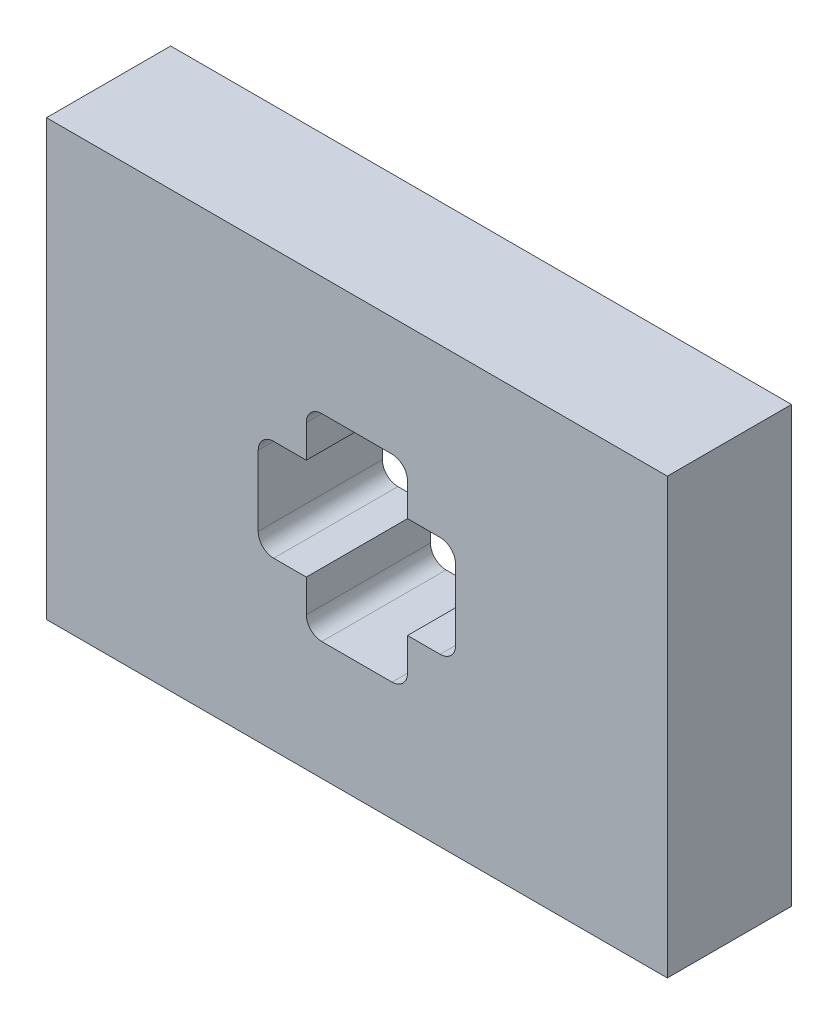
ISO-10303-21;
HEADER;
FILE_DESCRIPTION(('STEP AP214'),'2;1');
FILE_NAME('part.step','',(''),(''),'','','');
FILE_SCHEMA(('AUTOMOTIVE_DESIGN { 1 0 10303 214 1 1 1 1 }'));
ENDSEC;
DATA;
#1=APPLICATION_CONTEXT('core data for automotive mechanical design processes');
#2=APPLICATION_PROTOCOL_DEFINITION('international standard','automotive_design',2000,#1);
#3=PRODUCT_CONTEXT('',#1,'mechanical');
#4=PRODUCT('Part','Part','',(#3));
#5=PRODUCT_RELATED_PRODUCT_CATEGORY('part','',(#4));
#6=PRODUCT_DEFINITION_FORMATION('','',#4);
#7=PRODUCT_DEFINITION_CONTEXT('part definition',#1,'design');
#8=PRODUCT_DEFINITION('design','',#6,#7);
#9=PRODUCT_DEFINITION_SHAPE('','',#8);
#10=(LENGTH_UNIT() NAMED_UNIT(*) SI_UNIT(.MILLI.,.METRE.));
#11=(NAMED_UNIT(*) PLANE_ANGLE_UNIT() SI_UNIT($,.RADIAN.));
#12=(NAMED_UNIT(*) SI_UNIT($,.STERADIAN.) SOLID_ANGLE_UNIT());
#13=UNCERTAINTY_MEASURE_WITH_UNIT(LENGTH_MEASURE(1.E-05),#10,'distance_accuracy_value','');
#14=(GEOMETRIC_REPRESENTATION_CONTEXT(3) GLOBAL_UNCERTAINTY_ASSIGNED_CONTEXT((#13)) GLOBAL_UNIT_ASSIGNED_CONTEXT((#10,
#11,#12)) REPRESENTATION_CONTEXT('',''));
#15=CARTESIAN_POINT('',(0.,0.,0.));
#16=DIRECTION('',(0.,0.,1.));
#17=DIRECTION('',(1.,0.,0.));
#18=AXIS2_PLACEMENT_3D('',#15,#16,#17);
#19=CARTESIAN_POINT('',(0.,0.,20.));
#20=DIRECTION('',(0.,0.,1.));
#21=DIRECTION('',(1.,0.,0.));
#22=AXIS2_PLACEMENT_3D('',#19,#20,#21);
#23=PLANE('',#22);
#24=DIRECTION('',(0.,-1.,0.));
#25=VECTOR('',#24,1.);
#26=CARTESIAN_POINT('',(-50.,-35.,20.));
#27=LINE('',#26,#25);
#28=CARTESIAN_POINT('',(-50.,35.,20.));
#29=VERTEX_POINT('',#28);
#30=CARTESIAN_POINT('',(-50.,-35.,20.));
#31=VERTEX_POINT('',#30);
#32=EDGE_CURVE('E343',#29,#31,#27,.T.);
#33=ORIENTED_EDGE('',*,*,#32,.T.);
#34=DIRECTION('',(1.,0.,0.));
#35=VECTOR('',#34,1.);
#36=CARTESIAN_POINT('',(50.,-35.,20.));
#37=LINE('',#36,#35);
#38=CARTESIAN_POINT('',(50.,-35.,20.));
#39=VERTEX_POINT('',#38);
#40=EDGE_CURVE('E346',#31,#39,#37,.T.);
#41=ORIENTED_EDGE('',*,*,#40,.T.);
#42=DIRECTION('',(0.,1.,0.));
#43=VECTOR('',#42,1.);
#44=CARTESIAN_POINT('',(50.,-35.,20.));
#45=LINE('',#44,#43);
#46=CARTESIAN_POINT('',(50.,35.,20.));
#47=VERTEX_POINT('',#46);
#48=EDGE_CURVE('E349',#39,#47,#45,.T.);
#49=ORIENTED_EDGE('',*,*,#48,.T.);
#50=DIRECTION('',(-1.,0.,0.));
#51=VECTOR('',#50,1.);
#52=CARTESIAN_POINT('',(50.,35.,20.));
#53=LINE('',#52,#51);
#54=EDGE_CURVE('E351',#47,#29,#53,.T.);
#55=ORIENTED_EDGE('',*,*,#54,.T.);
#56=EDGE_LOOP('',(#33,#41,#49,#55));
#57=FACE_BOUND('',#56,.T.);
#58=DIRECTION('',(0.,-1.,0.));
#59=VECTOR('',#58,1.);
#60=CARTESIAN_POINT('',(-8.15,13.4,20.));
#61=LINE('',#60,#59);
#62=CARTESIAN_POINT('',(-8.15,13.4,20.));
#63=VERTEX_POINT('',#62);
#64=CARTESIAN_POINT('',(-8.15,8.15,20.));
#65=VERTEX_POINT('',#64);
#66=EDGE_CURVE('E202',#63,#65,#61,.T.);
#67=ORIENTED_EDGE('',*,*,#66,.F.);
#68=CARTESIAN_POINT('',(-5.65,13.4,20.));
#69=DIRECTION('',(0.,0.,1.));
#70=DIRECTION('',(-1.,0.,0.));
#71=AXIS2_PLACEMENT_3D('',#68,#69,#70);
#72=CIRCLE('',#71,2.5);
#73=CARTESIAN_POINT('',(-5.64999999999998,15.9,20.));
#74=VERTEX_POINT('',#73);
#75=EDGE_CURVE('E194',#74,#63,#72,.T.);
#76=ORIENTED_EDGE('',*,*,#75,.F.);
#77=DIRECTION('',(-1.,0.,0.));
#78=VECTOR('',#77,1.);
#79=CARTESIAN_POINT('',(5.65000000000003,15.9,20.));
#80=LINE('',#79,#78);
#81=CARTESIAN_POINT('',(5.65000000000003,15.9,20.));
#82=VERTEX_POINT('',#81);
#83=EDGE_CURVE('E251',#82,#74,#80,.T.);
#84=ORIENTED_EDGE('',*,*,#83,.F.);
#85=CARTESIAN_POINT('',(5.65000000000004,13.4,20.));
#86=DIRECTION('',(0.,0.,1.));
#87=DIRECTION('',(1.,0.,0.));
#88=AXIS2_PLACEMENT_3D('',#85,#86,#87);
#89=CIRCLE('',#88,2.5);
#90=CARTESIAN_POINT('',(8.15000000000004,13.4,20.));
#91=VERTEX_POINT('',#90);
#92=EDGE_CURVE('E249',#91,#82,#89,.T.);
#93=ORIENTED_EDGE('',*,*,#92,.F.);
#94=DIRECTION('',(0.,1.,0.));
#95=VECTOR('',#94,1.);
#96=CARTESIAN_POINT('',(8.15000000000004,13.4,20.));
#97=LINE('',#96,#95);
#98=CARTESIAN_POINT('',(8.15000000000013,8.15000000000013,20.));
#99=VERTEX_POINT('',#98);
#100=EDGE_CURVE('E247',#99,#91,#97,.T.);
#101=ORIENTED_EDGE('',*,*,#100,.F.);
#102=DIRECTION('',(-1.,0.,0.));
#103=VECTOR('',#102,1.);
#104=CARTESIAN_POINT('',(8.15000000000013,8.15000000000013,20.));
#105=LINE('',#104,#103);
#106=CARTESIAN_POINT('',(13.4,8.15000000000004,20.));
#107=VERTEX_POINT('',#106);
#108=EDGE_CURVE('E245',#107,#99,#105,.T.);
#109=ORIENTED_EDGE('',*,*,#108,.F.);
#110=CARTESIAN_POINT('',(13.4,5.65000000000004,20.));
#111=DIRECTION('',(0.,0.,1.));
#112=DIRECTION('',(1.,0.,0.));
#113=AXIS2_PLACEMENT_3D('',#110,#111,#112);
#114=CIRCLE('',#113,2.5);
#115=CARTESIAN_POINT('',(15.9,5.65000000000003,20.));
#116=VERTEX_POINT('',#115);
#117=EDGE_CURVE('E243',#116,#107,#114,.T.);
#118=ORIENTED_EDGE('',*,*,#117,.F.);
#119=DIRECTION('',(0.,1.,0.));
#120=VECTOR('',#119,1.);
#121=CARTESIAN_POINT('',(15.9,-5.65000000000003,20.));
#122=LINE('',#121,#120);
#123=CARTESIAN_POINT('',(15.9,-5.65000000000003,20.));
#124=VERTEX_POINT('',#123);
#125=EDGE_CURVE('E241',#124,#116,#122,.T.);
#126=ORIENTED_EDGE('',*,*,#125,.F.);
#127=CARTESIAN_POINT('',(13.4,-5.65000000000005,20.));
#128=DIRECTION('',(0.,0.,1.));
#129=DIRECTION('',(-1.,0.,0.));
#130=AXIS2_PLACEMENT_3D('',#127,#128,#129);
#131=CIRCLE('',#130,2.5);
#132=CARTESIAN_POINT('',(13.4,-8.15000000000005,20.));
#133=VERTEX_POINT('',#132);
#134=EDGE_CURVE('E239',#133,#124,#131,.T.);
#135=ORIENTED_EDGE('',*,*,#134,.F.);
#136=DIRECTION('',(1.,0.,0.));
#137=VECTOR('',#136,1.);
#138=CARTESIAN_POINT('',(8.15000000000014,-8.15000000000014,20.));
#139=LINE('',#138,#137);
#140=CARTESIAN_POINT('',(8.15000000000014,-8.15000000000014,20.));
#141=VERTEX_POINT('',#140);
#142=EDGE_CURVE('E237',#141,#133,#139,.T.);
#143=ORIENTED_EDGE('',*,*,#142,.F.);
#144=DIRECTION('',(0.,1.,0.));
#145=VECTOR('',#144,1.);
#146=CARTESIAN_POINT('',(8.15000000000014,-8.15000000000014,20.));
#147=LINE('',#146,#145);
#148=CARTESIAN_POINT('',(8.15000000000004,-13.4,20.));
#149=VERTEX_POINT('',#148);
#150=EDGE_CURVE('E235',#149,#141,#147,.T.);
#151=ORIENTED_EDGE('',*,*,#150,.F.);
#152=CARTESIAN_POINT('',(5.65000000000004,-13.4,20.));
#153=DIRECTION('',(0.,0.,1.));
#154=DIRECTION('',(1.,0.,0.));
#155=AXIS2_PLACEMENT_3D('',#152,#153,#154);
#156=CIRCLE('',#155,2.5);
#157=CARTESIAN_POINT('',(5.65000000000003,-15.9,20.));
#158=VERTEX_POINT('',#157);
#159=EDGE_CURVE('E233',#158,#149,#156,.T.);
#160=ORIENTED_EDGE('',*,*,#159,.F.);
#161=DIRECTION('',(1.,0.,0.));
#162=VECTOR('',#161,1.);
#163=CARTESIAN_POINT('',(5.65000000000003,-15.9,20.));
#164=LINE('',#163,#162);
#165=CARTESIAN_POINT('',(-5.65000000000002,-15.9,20.));
#166=VERTEX_POINT('',#165);
#167=EDGE_CURVE('E231',#166,#158,#164,.T.);
#168=ORIENTED_EDGE('',*,*,#167,.F.);
#169=CARTESIAN_POINT('',(-5.65000000000004,-13.4,20.));
#170=DIRECTION('',(0.,0.,1.));
#171=DIRECTION('',(-1.,0.,0.));
#172=AXIS2_PLACEMENT_3D('',#169,#170,#171);
#173=CIRCLE('',#172,2.5);
#174=CARTESIAN_POINT('',(-8.15000000000004,-13.4,20.));
#175=VERTEX_POINT('',#174);
#176=EDGE_CURVE('E229',#175,#166,#173,.T.);
#177=ORIENTED_EDGE('',*,*,#176,.F.);
#178=DIRECTION('',(0.,-1.,0.));
#179=VECTOR('',#178,1.);
#180=CARTESIAN_POINT('',(-8.15000000000013,-8.15000000000013,20.));
#181=LINE('',#180,#179);
#182=CARTESIAN_POINT('',(-8.15000000000013,-8.15000000000013,20.));
#183=VERTEX_POINT('',#182);
#184=EDGE_CURVE('E227',#183,#175,#181,.T.);
#185=ORIENTED_EDGE('',*,*,#184,.F.);
#186=DIRECTION('',(1.,0.,0.));
#187=VECTOR('',#186,1.);
#188=CARTESIAN_POINT('',(-13.4,-8.15000000000004,20.));
#189=LINE('',#188,#187);
#190=CARTESIAN_POINT('',(-13.4,-8.15000000000004,20.));
#191=VERTEX_POINT('',#190);
#192=EDGE_CURVE('E225',#191,#183,#189,.T.);
#193=ORIENTED_EDGE('',*,*,#192,.F.);
#194=CARTESIAN_POINT('',(-13.4,-5.65000000000004,20.));
#195=DIRECTION('',(0.,0.,1.));
#196=DIRECTION('',(-1.,0.,0.));
#197=AXIS2_PLACEMENT_3D('',#194,#195,#196);
#198=CIRCLE('',#197,2.5);
#199=CARTESIAN_POINT('',(-15.9,-5.65000000000003,20.));
#200=VERTEX_POINT('',#199);
#201=EDGE_CURVE('E223',#200,#191,#198,.T.);
#202=ORIENTED_EDGE('',*,*,#201,.F.);
#203=DIRECTION('',(0.,-1.,0.));
#204=VECTOR('',#203,1.);
#205=CARTESIAN_POINT('',(-15.9,-5.65000000000003,20.));
#206=LINE('',#205,#204);
#207=CARTESIAN_POINT('',(-15.9,5.64999999999999,20.));
#208=VERTEX_POINT('',#207);
#209=EDGE_CURVE('E221',#208,#200,#206,.T.);
#210=ORIENTED_EDGE('',*,*,#209,.F.);
#211=CARTESIAN_POINT('',(-13.4,5.65,20.));
#212=DIRECTION('',(0.,0.,1.));
#213=DIRECTION('',(1.,0.,0.));
#214=AXIS2_PLACEMENT_3D('',#211,#212,#213);
#215=CIRCLE('',#214,2.5);
#216=CARTESIAN_POINT('',(-13.4,8.15,20.));
#217=VERTEX_POINT('',#216);
#218=EDGE_CURVE('E217',#217,#208,#215,.T.);
#219=ORIENTED_EDGE('',*,*,#218,.F.);
#220=DIRECTION('',(-1.,0.,0.));
#221=VECTOR('',#220,1.);
#222=CARTESIAN_POINT('',(-13.4,8.15,20.));
#223=LINE('',#222,#221);
#224=EDGE_CURVE('E215',#65,#217,#223,.T.);
#225=ORIENTED_EDGE('',*,*,#224,.F.);
#226=EDGE_LOOP('',(#67,#76,#84,#93,#101,#109,#118,#126,#135,#143,#151,#160,#168,#177,#185,#193,
#202,#210,#219,#225));
#227=FACE_BOUND('',#226,.T.);
#228=ADVANCED_FACE('F33',(#57,#227),#23,.T.);
#229=CARTESIAN_POINT('',(0.,0.,0.));
#230=DIRECTION('',(0.,0.,1.));
#231=DIRECTION('',(1.,0.,0.));
#232=AXIS2_PLACEMENT_3D('',#229,#230,#231);
#233=PLANE('',#232);
#234=DIRECTION('',(0.,-1.,0.));
#235=VECTOR('',#234,1.);
#236=CARTESIAN_POINT('',(-50.,-35.,0.));
#237=LINE('',#236,#235);
#238=CARTESIAN_POINT('',(-50.,35.,0.));
#239=VERTEX_POINT('',#238);
#240=CARTESIAN_POINT('',(-50.,-35.,0.));
#241=VERTEX_POINT('',#240);
#242=EDGE_CURVE('E210',#239,#241,#237,.T.);
#243=ORIENTED_EDGE('',*,*,#242,.F.);
#244=DIRECTION('',(-1.,0.,0.));
#245=VECTOR('',#244,1.);
#246=CARTESIAN_POINT('',(50.,35.,0.));
#247=LINE('',#246,#245);
#248=CARTESIAN_POINT('',(50.,35.,0.));
#249=VERTEX_POINT('',#248);
#250=EDGE_CURVE('E347',#249,#239,#247,.T.);
#251=ORIENTED_EDGE('',*,*,#250,.F.);
#252=DIRECTION('',(0.,1.,0.));
#253=VECTOR('',#252,1.);
#254=CARTESIAN_POINT('',(50.,-35.,0.));
#255=LINE('',#254,#253);
#256=CARTESIAN_POINT('',(50.,-35.,0.));
#257=VERTEX_POINT('',#256);
#258=EDGE_CURVE('E358',#257,#249,#255,.T.);
#259=ORIENTED_EDGE('',*,*,#258,.F.);
#260=DIRECTION('',(1.,0.,0.));
#261=VECTOR('',#260,1.);
#262=CARTESIAN_POINT('',(50.,-35.,0.));
#263=LINE('',#262,#261);
#264=EDGE_CURVE('E356',#241,#257,#263,.T.);
#265=ORIENTED_EDGE('',*,*,#264,.F.);
#266=EDGE_LOOP('',(#243,#251,#259,#265));
#267=FACE_BOUND('',#266,.T.);
#268=CARTESIAN_POINT('',(-5.65,13.4,0.));
#269=DIRECTION('',(0.,0.,1.));
#270=DIRECTION('',(-1.,0.,0.));
#271=AXIS2_PLACEMENT_3D('',#268,#269,#270);
#272=CIRCLE('',#271,2.5);
#273=CARTESIAN_POINT('',(-5.64999999999998,15.9,0.));
#274=VERTEX_POINT('',#273);
#275=CARTESIAN_POINT('',(-8.15,13.4,0.));
#276=VERTEX_POINT('',#275);
#277=EDGE_CURVE('E56',#274,#276,#272,.T.);
#278=ORIENTED_EDGE('',*,*,#277,.T.);
#279=DIRECTION('',(0.,-1.,0.));
#280=VECTOR('',#279,1.);
#281=CARTESIAN_POINT('',(-8.15,13.4,0.));
#282=LINE('',#281,#280);
#283=CARTESIAN_POINT('',(-8.15,8.15,0.));
#284=VERTEX_POINT('',#283);
#285=EDGE_CURVE('E209',#276,#284,#282,.T.);
#286=ORIENTED_EDGE('',*,*,#285,.T.);
#287=DIRECTION('',(-1.,0.,0.));
#288=VECTOR('',#287,1.);
#289=CARTESIAN_POINT('',(-13.4,8.15,0.));
#290=LINE('',#289,#288);
#291=CARTESIAN_POINT('',(-13.4,8.15,0.));
#292=VERTEX_POINT('',#291);
#293=EDGE_CURVE('E255',#284,#292,#290,.T.);
#294=ORIENTED_EDGE('',*,*,#293,.T.);
#295=CARTESIAN_POINT('',(-13.4,5.65,0.));
#296=DIRECTION('',(0.,0.,1.));
#297=DIRECTION('',(1.,0.,0.));
#298=AXIS2_PLACEMENT_3D('',#295,#296,#297);
#299=CIRCLE('',#298,2.5);
#300=CARTESIAN_POINT('',(-15.9,5.64999999999999,0.));
#301=VERTEX_POINT('',#300);
#302=EDGE_CURVE('E258',#292,#301,#299,.T.);
#303=ORIENTED_EDGE('',*,*,#302,.T.);
#304=DIRECTION('',(0.,-1.,0.));
#305=VECTOR('',#304,1.);
#306=CARTESIAN_POINT('',(-15.9,-5.65000000000003,0.));
#307=LINE('',#306,#305);
#308=CARTESIAN_POINT('',(-15.9,-5.65000000000003,0.));
#309=VERTEX_POINT('',#308);
#310=EDGE_CURVE('E261',#301,#309,#307,.T.);
#311=ORIENTED_EDGE('',*,*,#310,.T.);
#312=CARTESIAN_POINT('',(-13.4,-5.65000000000004,0.));
#313=DIRECTION('',(0.,0.,1.));
#314=DIRECTION('',(-1.,0.,0.));
#315=AXIS2_PLACEMENT_3D('',#312,#313,#314);
#316=CIRCLE('',#315,2.5);
#317=CARTESIAN_POINT('',(-13.4,-8.15000000000004,0.));
#318=VERTEX_POINT('',#317);
#319=EDGE_CURVE('E264',#309,#318,#316,.T.);
#320=ORIENTED_EDGE('',*,*,#319,.T.);
#321=DIRECTION('',(1.,0.,0.));
#322=VECTOR('',#321,1.);
#323=CARTESIAN_POINT('',(-13.4,-8.15000000000004,0.));
#324=LINE('',#323,#322);
#325=CARTESIAN_POINT('',(-8.15000000000013,-8.15000000000013,0.));
#326=VERTEX_POINT('',#325);
#327=EDGE_CURVE('E267',#318,#326,#324,.T.);
#328=ORIENTED_EDGE('',*,*,#327,.T.);
#329=DIRECTION('',(0.,-1.,0.));
#330=VECTOR('',#329,1.);
#331=CARTESIAN_POINT('',(-8.15000000000013,-8.15000000000013,0.));
#332=LINE('',#331,#330);
#333=CARTESIAN_POINT('',(-8.15000000000004,-13.4,0.));
#334=VERTEX_POINT('',#333);
#335=EDGE_CURVE('E270',#326,#334,#332,.T.);
#336=ORIENTED_EDGE('',*,*,#335,.T.);
#337=CARTESIAN_POINT('',(-5.65000000000004,-13.4,0.));
#338=DIRECTION('',(0.,0.,1.));
#339=DIRECTION('',(-1.,0.,0.));
#340=AXIS2_PLACEMENT_3D('',#337,#338,#339);
#341=CIRCLE('',#340,2.5);
#342=CARTESIAN_POINT('',(-5.65000000000002,-15.9,0.));
#343=VERTEX_POINT('',#342);
#344=EDGE_CURVE('E273',#334,#343,#341,.T.);
#345=ORIENTED_EDGE('',*,*,#344,.T.);
#346=DIRECTION('',(1.,0.,0.));
#347=VECTOR('',#346,1.);
#348=CARTESIAN_POINT('',(5.65000000000003,-15.9,0.));
#349=LINE('',#348,#347);
#350=CARTESIAN_POINT('',(5.65000000000003,-15.9,0.));
#351=VERTEX_POINT('',#350);
#352=EDGE_CURVE('E276',#343,#351,#349,.T.);
#353=ORIENTED_EDGE('',*,*,#352,.T.);
#354=CARTESIAN_POINT('',(5.65000000000004,-13.4,0.));
#355=DIRECTION('',(0.,0.,1.));
#356=DIRECTION('',(1.,0.,0.));
#357=AXIS2_PLACEMENT_3D('',#354,#355,#356);
#358=CIRCLE('',#357,2.5);
#359=CARTESIAN_POINT('',(8.15000000000004,-13.4,0.));
#360=VERTEX_POINT('',#359);
#361=EDGE_CURVE('E279',#351,#360,#358,.T.);
#362=ORIENTED_EDGE('',*,*,#361,.T.);
#363=DIRECTION('',(0.,1.,0.));
#364=VECTOR('',#363,1.);
#365=CARTESIAN_POINT('',(8.15000000000014,-8.15000000000014,0.));
#366=LINE('',#365,#364);
#367=CARTESIAN_POINT('',(8.15000000000014,-8.15000000000014,0.));
#368=VERTEX_POINT('',#367);
#369=EDGE_CURVE('E282',#360,#368,#366,.T.);
#370=ORIENTED_EDGE('',*,*,#369,.T.);
#371=DIRECTION('',(1.,0.,0.));
#372=VECTOR('',#371,1.);
#373=CARTESIAN_POINT('',(8.15000000000014,-8.15000000000014,0.));
#374=LINE('',#373,#372);
#375=CARTESIAN_POINT('',(13.4,-8.15000000000005,0.));
#376=VERTEX_POINT('',#375);
#377=EDGE_CURVE('E285',#368,#376,#374,.T.);
#378=ORIENTED_EDGE('',*,*,#377,.T.);
#379=CARTESIAN_POINT('',(13.4,-5.65000000000005,0.));
#380=DIRECTION('',(0.,0.,1.));
#381=DIRECTION('',(-1.,0.,0.));
#382=AXIS2_PLACEMENT_3D('',#379,#380,#381);
#383=CIRCLE('',#382,2.5);
#384=CARTESIAN_POINT('',(15.9,-5.65000000000003,0.));
#385=VERTEX_POINT('',#384);
#386=EDGE_CURVE('E288',#376,#385,#383,.T.);
#387=ORIENTED_EDGE('',*,*,#386,.T.);
#388=DIRECTION('',(0.,1.,0.));
#389=VECTOR('',#388,1.);
#390=CARTESIAN_POINT('',(15.9,-5.65000000000003,0.));
#391=LINE('',#390,#389);
#392=CARTESIAN_POINT('',(15.9,5.65000000000003,0.));
#393=VERTEX_POINT('',#392);
#394=EDGE_CURVE('E291',#385,#393,#391,.T.);
#395=ORIENTED_EDGE('',*,*,#394,.T.);
#396=CARTESIAN_POINT('',(13.4,5.65000000000004,0.));
#397=DIRECTION('',(0.,0.,1.));
#398=DIRECTION('',(1.,0.,0.));
#399=AXIS2_PLACEMENT_3D('',#396,#397,#398);
#400=CIRCLE('',#399,2.5);
#401=CARTESIAN_POINT('',(13.4,8.15000000000004,0.));
#402=VERTEX_POINT('',#401);
#403=EDGE_CURVE('E294',#393,#402,#400,.T.);
#404=ORIENTED_EDGE('',*,*,#403,.T.);
#405=DIRECTION('',(-1.,0.,0.));
#406=VECTOR('',#405,1.);
#407=CARTESIAN_POINT('',(8.15000000000013,8.15000000000013,0.));
#408=LINE('',#407,#406);
#409=CARTESIAN_POINT('',(8.15000000000013,8.15000000000013,0.));
#410=VERTEX_POINT('',#409);
#411=EDGE_CURVE('E297',#402,#410,#408,.T.);
#412=ORIENTED_EDGE('',*,*,#411,.T.);
#413=DIRECTION('',(0.,1.,0.));
#414=VECTOR('',#413,1.);
#415=CARTESIAN_POINT('',(8.15000000000004,13.4,0.));
#416=LINE('',#415,#414);
#417=CARTESIAN_POINT('',(8.15000000000004,13.4,0.));
#418=VERTEX_POINT('',#417);
#419=EDGE_CURVE('E300',#410,#418,#416,.T.);
#420=ORIENTED_EDGE('',*,*,#419,.T.);
#421=CARTESIAN_POINT('',(5.65000000000004,13.4,0.));
#422=DIRECTION('',(0.,0.,1.));
#423=DIRECTION('',(1.,0.,0.));
#424=AXIS2_PLACEMENT_3D('',#421,#422,#423);
#425=CIRCLE('',#424,2.5);
#426=CARTESIAN_POINT('',(5.65000000000003,15.9,0.));
#427=VERTEX_POINT('',#426);
#428=EDGE_CURVE('E303',#418,#427,#425,.T.);
#429=ORIENTED_EDGE('',*,*,#428,.T.);
#430=DIRECTION('',(-1.,0.,0.));
#431=VECTOR('',#430,1.);
#432=CARTESIAN_POINT('',(5.65000000000003,15.9,0.));
#433=LINE('',#432,#431);
#434=EDGE_CURVE('E203',#427,#274,#433,.T.);
#435=ORIENTED_EDGE('',*,*,#434,.T.);
#436=EDGE_LOOP('',(#278,#286,#294,#303,#311,#320,#328,#336,#345,#353,#362,#370,#378,#387,#395,
#404,#412,#420,#429,#435));
#437=FACE_BOUND('',#436,.T.);
#438=ADVANCED_FACE('F376',(#267,#437),#233,.F.);
#439=CARTESIAN_POINT('',(-50.,-35.,20.));
#440=DIRECTION('',(1.,0.,0.));
#441=DIRECTION('',(0.,0.,-1.));
#442=AXIS2_PLACEMENT_3D('',#439,#440,#441);
#443=PLANE('',#442);
#444=ORIENTED_EDGE('',*,*,#242,.T.);
#445=DIRECTION('',(0.,0.,-1.));
#446=VECTOR('',#445,1.);
#447=CARTESIAN_POINT('',(-50.,-35.,20.));
#448=LINE('',#447,#446);
#449=EDGE_CURVE('E11',#31,#241,#448,.T.);
#450=ORIENTED_EDGE('',*,*,#449,.F.);
#451=ORIENTED_EDGE('',*,*,#32,.F.);
#452=DIRECTION('',(0.,0.,-1.));
#453=VECTOR('',#452,1.);
#454=CARTESIAN_POINT('',(-50.,35.,20.));
#455=LINE('',#454,#453);
#456=EDGE_CURVE('E353',#29,#239,#455,.T.);
#457=ORIENTED_EDGE('',*,*,#456,.T.);
#458=EDGE_LOOP('',(#444,#450,#451,#457));
#459=FACE_BOUND('',#458,.T.);
#460=ADVANCED_FACE('F35',(#459),#443,.F.);
#461=CARTESIAN_POINT('',(50.,-35.,20.));
#462=DIRECTION('',(0.,1.,0.));
#463=DIRECTION('',(-1.,0.,0.));
#464=AXIS2_PLACEMENT_3D('',#461,#462,#463);
#465=PLANE('',#464);
#466=ORIENTED_EDGE('',*,*,#264,.T.);
#467=DIRECTION('',(0.,0.,-1.));
#468=VECTOR('',#467,1.);
#469=CARTESIAN_POINT('',(50.,-35.,20.));
#470=LINE('',#469,#468);
#471=EDGE_CURVE('E41',#39,#257,#470,.T.);
#472=ORIENTED_EDGE('',*,*,#471,.F.);
#473=ORIENTED_EDGE('',*,*,#40,.F.);
#474=ORIENTED_EDGE('',*,*,#449,.T.);
#475=EDGE_LOOP('',(#466,#472,#473,#474));
#476=FACE_BOUND('',#475,.T.);
#477=ADVANCED_FACE('F386',(#476),#465,.F.);
#478=CARTESIAN_POINT('',(50.,-35.,20.));
#479=DIRECTION('',(-1.,0.,0.));
#480=DIRECTION('',(0.,0.,1.));
#481=AXIS2_PLACEMENT_3D('',#478,#479,#480);
#482=PLANE('',#481);
#483=ORIENTED_EDGE('',*,*,#258,.T.);
#484=DIRECTION('',(0.,0.,-1.));
#485=VECTOR('',#484,1.);
#486=CARTESIAN_POINT('',(50.,35.,20.));
#487=LINE('',#486,#485);
#488=EDGE_CURVE('E363',#47,#249,#487,.T.);
#489=ORIENTED_EDGE('',*,*,#488,.F.);
#490=ORIENTED_EDGE('',*,*,#48,.F.);
#491=ORIENTED_EDGE('',*,*,#471,.T.);
#492=EDGE_LOOP('',(#483,#489,#490,#491));
#493=FACE_BOUND('',#492,.T.);
#494=ADVANCED_FACE('F370',(#493),#482,.F.);
#495=CARTESIAN_POINT('',(50.,35.,20.));
#496=DIRECTION('',(0.,-1.,0.));
#497=DIRECTION('',(1.,0.,0.));
#498=AXIS2_PLACEMENT_3D('',#495,#496,#497);
#499=PLANE('',#498);
#500=ORIENTED_EDGE('',*,*,#250,.T.);
#501=ORIENTED_EDGE('',*,*,#456,.F.);
#502=ORIENTED_EDGE('',*,*,#54,.F.);
#503=ORIENTED_EDGE('',*,*,#488,.T.);
#504=EDGE_LOOP('',(#500,#501,#502,#503));
#505=FACE_BOUND('',#504,.T.);
#506=ADVANCED_FACE('F380',(#505),#499,.F.);
#507=CARTESIAN_POINT('',(-5.65,13.4,20.));
#508=DIRECTION('',(0.,0.,-1.));
#509=DIRECTION('',(-1.,0.,0.));
#510=AXIS2_PLACEMENT_3D('',#507,#508,#509);
#511=CYLINDRICAL_SURFACE('',#510,2.5);
#512=ORIENTED_EDGE('',*,*,#277,.F.);
#513=DIRECTION('',(0.,0.,-1.));
#514=VECTOR('',#513,1.);
#515=CARTESIAN_POINT('',(-5.64999999999998,15.9,20.));
#516=LINE('',#515,#514);
#517=EDGE_CURVE('E198',#74,#274,#516,.T.);
#518=ORIENTED_EDGE('',*,*,#517,.F.);
#519=ORIENTED_EDGE('',*,*,#75,.T.);
#520=DIRECTION('',(0.,0.,-1.));
#521=VECTOR('',#520,1.);
#522=CARTESIAN_POINT('',(-8.15,13.4,20.));
#523=LINE('',#522,#521);
#524=EDGE_CURVE('E197',#63,#276,#523,.T.);
#525=ORIENTED_EDGE('',*,*,#524,.T.);
#526=EDGE_LOOP('',(#512,#518,#519,#525));
#527=FACE_BOUND('',#526,.T.);
#528=ADVANCED_FACE('F196',(#527),#511,.F.);
#529=CARTESIAN_POINT('',(-8.15,13.4,20.));
#530=DIRECTION('',(1.,0.,0.));
#531=DIRECTION('',(0.,1.,0.));
#532=AXIS2_PLACEMENT_3D('',#529,#530,#531);
#533=PLANE('',#532);
#534=ORIENTED_EDGE('',*,*,#285,.F.);
#535=ORIENTED_EDGE('',*,*,#524,.F.);
#536=ORIENTED_EDGE('',*,*,#66,.T.);
#537=DIRECTION('',(0.,0.,-1.));
#538=VECTOR('',#537,1.);
#539=CARTESIAN_POINT('',(-8.15,8.15,20.));
#540=LINE('',#539,#538);
#541=EDGE_CURVE('E211',#65,#284,#540,.T.);
#542=ORIENTED_EDGE('',*,*,#541,.T.);
#543=EDGE_LOOP('',(#534,#535,#536,#542));
#544=FACE_BOUND('',#543,.T.);
#545=ADVANCED_FACE('F206',(#544),#533,.T.);
#546=CARTESIAN_POINT('',(-13.4,8.15,20.));
#547=DIRECTION('',(0.,-1.,0.));
#548=DIRECTION('',(1.,0.,0.));
#549=AXIS2_PLACEMENT_3D('',#546,#547,#548);
#550=PLANE('',#549);
#551=ORIENTED_EDGE('',*,*,#293,.F.);
#552=ORIENTED_EDGE('',*,*,#541,.F.);
#553=ORIENTED_EDGE('',*,*,#224,.T.);
#554=DIRECTION('',(0.,0.,-1.));
#555=VECTOR('',#554,1.);
#556=CARTESIAN_POINT('',(-13.4,8.15,20.));
#557=LINE('',#556,#555);
#558=EDGE_CURVE('E340',#217,#292,#557,.T.);
#559=ORIENTED_EDGE('',*,*,#558,.T.);
#560=EDGE_LOOP('',(#551,#552,#553,#559));
#561=FACE_BOUND('',#560,.T.);
#562=ADVANCED_FACE('F409',(#561),#550,.T.);
#563=CARTESIAN_POINT('',(-13.4,5.65,20.));
#564=DIRECTION('',(0.,0.,-1.));
#565=DIRECTION('',(-1.,0.,0.));
#566=AXIS2_PLACEMENT_3D('',#563,#564,#565);
#567=CYLINDRICAL_SURFACE('',#566,2.5);
#568=ORIENTED_EDGE('',*,*,#302,.F.);
#569=ORIENTED_EDGE('',*,*,#558,.F.);
#570=ORIENTED_EDGE('',*,*,#218,.T.);
#571=DIRECTION('',(0.,0.,-1.));
#572=VECTOR('',#571,1.);
#573=CARTESIAN_POINT('',(-15.9,5.64999999999999,20.));
#574=LINE('',#573,#572);
#575=EDGE_CURVE('E338',#208,#301,#574,.T.);
#576=ORIENTED_EDGE('',*,*,#575,.T.);
#577=EDGE_LOOP('',(#568,#569,#570,#576));
#578=FACE_BOUND('',#577,.T.);
#579=ADVANCED_FACE('F413',(#578),#567,.F.);
#580=CARTESIAN_POINT('',(-15.9,-5.65000000000003,20.));
#581=DIRECTION('',(1.,0.,0.));
#582=DIRECTION('',(0.,0.,-1.));
#583=AXIS2_PLACEMENT_3D('',#580,#581,#582);
#584=PLANE('',#583);
#585=ORIENTED_EDGE('',*,*,#310,.F.);
#586=ORIENTED_EDGE('',*,*,#575,.F.);
#587=ORIENTED_EDGE('',*,*,#209,.T.);
#588=DIRECTION('',(0.,0.,-1.));
#589=VECTOR('',#588,1.);
#590=CARTESIAN_POINT('',(-15.9,-5.65000000000003,20.));
#591=LINE('',#590,#589);
#592=EDGE_CURVE('E336',#200,#309,#591,.T.);
#593=ORIENTED_EDGE('',*,*,#592,.T.);
#594=EDGE_LOOP('',(#585,#586,#587,#593));
#595=FACE_BOUND('',#594,.T.);
#596=ADVANCED_FACE('F419',(#595),#584,.T.);
#597=CARTESIAN_POINT('',(-13.4,-5.65000000000004,20.));
#598=DIRECTION('',(0.,0.,-1.));
#599=DIRECTION('',(-1.,0.,0.));
#600=AXIS2_PLACEMENT_3D('',#597,#598,#599);
#601=CYLINDRICAL_SURFACE('',#600,2.5);
#602=ORIENTED_EDGE('',*,*,#319,.F.);
#603=ORIENTED_EDGE('',*,*,#592,.F.);
#604=ORIENTED_EDGE('',*,*,#201,.T.);
#605=DIRECTION('',(0.,0.,-1.));
#606=VECTOR('',#605,1.);
#607=CARTESIAN_POINT('',(-13.4,-8.15000000000004,20.));
#608=LINE('',#607,#606);
#609=EDGE_CURVE('E334',#191,#318,#608,.T.);
#610=ORIENTED_EDGE('',*,*,#609,.T.);
#611=EDGE_LOOP('',(#602,#603,#604,#610));
#612=FACE_BOUND('',#611,.T.);
#613=ADVANCED_FACE('F423',(#612),#601,.F.);
#614=CARTESIAN_POINT('',(-13.4,-8.15000000000004,20.));
#615=DIRECTION('',(0.,1.,0.));
#616=DIRECTION('',(-1.,0.,0.));
#617=AXIS2_PLACEMENT_3D('',#614,#615,#616);
#618=PLANE('',#617);
#619=ORIENTED_EDGE('',*,*,#327,.F.);
#620=ORIENTED_EDGE('',*,*,#609,.F.);
#621=ORIENTED_EDGE('',*,*,#192,.T.);
#622=DIRECTION('',(0.,0.,-1.));
#623=VECTOR('',#622,1.);
#624=CARTESIAN_POINT('',(-8.15000000000013,-8.15000000000013,20.));
#625=LINE('',#624,#623);
#626=EDGE_CURVE('E332',#183,#326,#625,.T.);
#627=ORIENTED_EDGE('',*,*,#626,.T.);
#628=EDGE_LOOP('',(#619,#620,#621,#627));
#629=FACE_BOUND('',#628,.T.);
#630=ADVANCED_FACE('F427',(#629),#618,.T.);
#631=CARTESIAN_POINT('',(-8.15000000000013,-8.15000000000013,20.));
#632=DIRECTION('',(1.,0.,0.));
#633=DIRECTION('',(0.,1.,0.));
#634=AXIS2_PLACEMENT_3D('',#631,#632,#633);
#635=PLANE('',#634);
#636=ORIENTED_EDGE('',*,*,#335,.F.);
#637=ORIENTED_EDGE('',*,*,#626,.F.);
#638=ORIENTED_EDGE('',*,*,#184,.T.);
#639=DIRECTION('',(0.,0.,-1.));
#640=VECTOR('',#639,1.);
#641=CARTESIAN_POINT('',(-8.15000000000004,-13.4,20.));
#642=LINE('',#641,#640);
#643=EDGE_CURVE('E330',#175,#334,#642,.T.);
#644=ORIENTED_EDGE('',*,*,#643,.T.);
#645=EDGE_LOOP('',(#636,#637,#638,#644));
#646=FACE_BOUND('',#645,.T.);
#647=ADVANCED_FACE('F431',(#646),#635,.T.);
#648=CARTESIAN_POINT('',(-5.65000000000004,-13.4,20.));
#649=DIRECTION('',(0.,0.,-1.));
#650=DIRECTION('',(-1.,0.,0.));
#651=AXIS2_PLACEMENT_3D('',#648,#649,#650);
#652=CYLINDRICAL_SURFACE('',#651,2.5);
#653=ORIENTED_EDGE('',*,*,#344,.F.);
#654=ORIENTED_EDGE('',*,*,#643,.F.);
#655=ORIENTED_EDGE('',*,*,#176,.T.);
#656=DIRECTION('',(0.,0.,-1.));
#657=VECTOR('',#656,1.);
#658=CARTESIAN_POINT('',(-5.65000000000002,-15.9,20.));
#659=LINE('',#658,#657);
#660=EDGE_CURVE('E328',#166,#343,#659,.T.);
#661=ORIENTED_EDGE('',*,*,#660,.T.);
#662=EDGE_LOOP('',(#653,#654,#655,#661));
#663=FACE_BOUND('',#662,.T.);
#664=ADVANCED_FACE('F435',(#663),#652,.F.);
#665=CARTESIAN_POINT('',(5.65000000000003,-15.9,20.));
#666=DIRECTION('',(0.,1.,0.));
#667=DIRECTION('',(0.,0.,1.));
#668=AXIS2_PLACEMENT_3D('',#665,#666,#667);
#669=PLANE('',#668);
#670=ORIENTED_EDGE('',*,*,#352,.F.);
#671=ORIENTED_EDGE('',*,*,#660,.F.);
#672=ORIENTED_EDGE('',*,*,#167,.T.);
#673=DIRECTION('',(0.,0.,-1.));
#674=VECTOR('',#673,1.);
#675=CARTESIAN_POINT('',(5.65000000000003,-15.9,20.));
#676=LINE('',#675,#674);
#677=EDGE_CURVE('E326',#158,#351,#676,.T.);
#678=ORIENTED_EDGE('',*,*,#677,.T.);
#679=EDGE_LOOP('',(#670,#671,#672,#678));
#680=FACE_BOUND('',#679,.T.);
#681=ADVANCED_FACE('F439',(#680),#669,.T.);
#682=CARTESIAN_POINT('',(5.65000000000004,-13.4,20.));
#683=DIRECTION('',(0.,0.,-1.));
#684=DIRECTION('',(-1.,0.,0.));
#685=AXIS2_PLACEMENT_3D('',#682,#683,#684);
#686=CYLINDRICAL_SURFACE('',#685,2.5);
#687=ORIENTED_EDGE('',*,*,#361,.F.);
#688=ORIENTED_EDGE('',*,*,#677,.F.);
#689=ORIENTED_EDGE('',*,*,#159,.T.);
#690=DIRECTION('',(0.,0.,-1.));
#691=VECTOR('',#690,1.);
#692=CARTESIAN_POINT('',(8.15000000000004,-13.4,20.));
#693=LINE('',#692,#691);
#694=EDGE_CURVE('E324',#149,#360,#693,.T.);
#695=ORIENTED_EDGE('',*,*,#694,.T.);
#696=EDGE_LOOP('',(#687,#688,#689,#695));
#697=FACE_BOUND('',#696,.T.);
#698=ADVANCED_FACE('F443',(#697),#686,.F.);
#699=CARTESIAN_POINT('',(8.15000000000014,-8.15000000000014,20.));
#700=DIRECTION('',(-1.,0.,0.));
#701=DIRECTION('',(0.,-1.,0.));
#702=AXIS2_PLACEMENT_3D('',#699,#700,#701);
#703=PLANE('',#702);
#704=ORIENTED_EDGE('',*,*,#369,.F.);
#705=ORIENTED_EDGE('',*,*,#694,.F.);
#706=ORIENTED_EDGE('',*,*,#150,.T.);
#707=DIRECTION('',(0.,0.,-1.));
#708=VECTOR('',#707,1.);
#709=CARTESIAN_POINT('',(8.15000000000014,-8.15000000000014,20.));
#710=LINE('',#709,#708);
#711=EDGE_CURVE('E322',#141,#368,#710,.T.);
#712=ORIENTED_EDGE('',*,*,#711,.T.);
#713=EDGE_LOOP('',(#704,#705,#706,#712));
#714=FACE_BOUND('',#713,.T.);
#715=ADVANCED_FACE('F447',(#714),#703,.T.);
#716=CARTESIAN_POINT('',(8.15000000000014,-8.15000000000014,20.));
#717=DIRECTION('',(0.,1.,0.));
#718=DIRECTION('',(-1.,0.,0.));
#719=AXIS2_PLACEMENT_3D('',#716,#717,#718);
#720=PLANE('',#719);
#721=ORIENTED_EDGE('',*,*,#377,.F.);
#722=ORIENTED_EDGE('',*,*,#711,.F.);
#723=ORIENTED_EDGE('',*,*,#142,.T.);
#724=DIRECTION('',(0.,0.,-1.));
#725=VECTOR('',#724,1.);
#726=CARTESIAN_POINT('',(13.4,-8.15000000000005,20.));
#727=LINE('',#726,#725);
#728=EDGE_CURVE('E320',#133,#376,#727,.T.);
#729=ORIENTED_EDGE('',*,*,#728,.T.);
#730=EDGE_LOOP('',(#721,#722,#723,#729));
#731=FACE_BOUND('',#730,.T.);
#732=ADVANCED_FACE('F451',(#731),#720,.T.);
#733=CARTESIAN_POINT('',(13.4,-5.65000000000005,20.));
#734=DIRECTION('',(0.,0.,-1.));
#735=DIRECTION('',(-1.,0.,0.));
#736=AXIS2_PLACEMENT_3D('',#733,#734,#735);
#737=CYLINDRICAL_SURFACE('',#736,2.5);
#738=ORIENTED_EDGE('',*,*,#386,.F.);
#739=ORIENTED_EDGE('',*,*,#728,.F.);
#740=ORIENTED_EDGE('',*,*,#134,.T.);
#741=DIRECTION('',(0.,0.,-1.));
#742=VECTOR('',#741,1.);
#743=CARTESIAN_POINT('',(15.9,-5.65000000000003,20.));
#744=LINE('',#743,#742);
#745=EDGE_CURVE('E318',#124,#385,#744,.T.);
#746=ORIENTED_EDGE('',*,*,#745,.T.);
#747=EDGE_LOOP('',(#738,#739,#740,#746));
#748=FACE_BOUND('',#747,.T.);
#749=ADVANCED_FACE('F455',(#748),#737,.F.);
#750=CARTESIAN_POINT('',(15.9,-5.65000000000003,20.));
#751=DIRECTION('',(-1.,0.,0.));
#752=DIRECTION('',(0.,0.,1.));
#753=AXIS2_PLACEMENT_3D('',#750,#751,#752);
#754=PLANE('',#753);
#755=ORIENTED_EDGE('',*,*,#394,.F.);
#756=ORIENTED_EDGE('',*,*,#745,.F.);
#757=ORIENTED_EDGE('',*,*,#125,.T.);
#758=DIRECTION('',(0.,0.,-1.));
#759=VECTOR('',#758,1.);
#760=CARTESIAN_POINT('',(15.9,5.65000000000003,20.));
#761=LINE('',#760,#759);
#762=EDGE_CURVE('E316',#116,#393,#761,.T.);
#763=ORIENTED_EDGE('',*,*,#762,.T.);
#764=EDGE_LOOP('',(#755,#756,#757,#763));
#765=FACE_BOUND('',#764,.T.);
#766=ADVANCED_FACE('F459',(#765),#754,.T.);
#767=CARTESIAN_POINT('',(13.4,5.65000000000004,20.));
#768=DIRECTION('',(0.,0.,-1.));
#769=DIRECTION('',(-1.,0.,0.));
#770=AXIS2_PLACEMENT_3D('',#767,#768,#769);
#771=CYLINDRICAL_SURFACE('',#770,2.5);
#772=ORIENTED_EDGE('',*,*,#403,.F.);
#773=ORIENTED_EDGE('',*,*,#762,.F.);
#774=ORIENTED_EDGE('',*,*,#117,.T.);
#775=DIRECTION('',(0.,0.,-1.));
#776=VECTOR('',#775,1.);
#777=CARTESIAN_POINT('',(13.4,8.15000000000004,20.));
#778=LINE('',#777,#776);
#779=EDGE_CURVE('E314',#107,#402,#778,.T.);
#780=ORIENTED_EDGE('',*,*,#779,.T.);
#781=EDGE_LOOP('',(#772,#773,#774,#780));
#782=FACE_BOUND('',#781,.T.);
#783=ADVANCED_FACE('F463',(#782),#771,.F.);
#784=CARTESIAN_POINT('',(8.15000000000013,8.15000000000013,20.));
#785=DIRECTION('',(0.,-1.,0.));
#786=DIRECTION('',(1.,0.,0.));
#787=AXIS2_PLACEMENT_3D('',#784,#785,#786);
#788=PLANE('',#787);
#789=ORIENTED_EDGE('',*,*,#411,.F.);
#790=ORIENTED_EDGE('',*,*,#779,.F.);
#791=ORIENTED_EDGE('',*,*,#108,.T.);
#792=DIRECTION('',(0.,0.,-1.));
#793=VECTOR('',#792,1.);
#794=CARTESIAN_POINT('',(8.15000000000013,8.15000000000013,20.));
#795=LINE('',#794,#793);
#796=EDGE_CURVE('E312',#99,#410,#795,.T.);
#797=ORIENTED_EDGE('',*,*,#796,.T.);
#798=EDGE_LOOP('',(#789,#790,#791,#797));
#799=FACE_BOUND('',#798,.T.);
#800=ADVANCED_FACE('F467',(#799),#788,.T.);
#801=CARTESIAN_POINT('',(8.15000000000004,13.4,20.));
#802=DIRECTION('',(-1.,0.,0.));
#803=DIRECTION('',(0.,-1.,0.));
#804=AXIS2_PLACEMENT_3D('',#801,#802,#803);
#805=PLANE('',#804);
#806=ORIENTED_EDGE('',*,*,#419,.F.);
#807=ORIENTED_EDGE('',*,*,#796,.F.);
#808=ORIENTED_EDGE('',*,*,#100,.T.);
#809=DIRECTION('',(0.,0.,-1.));
#810=VECTOR('',#809,1.);
#811=CARTESIAN_POINT('',(8.15000000000004,13.4,20.));
#812=LINE('',#811,#810);
#813=EDGE_CURVE('E310',#91,#418,#812,.T.);
#814=ORIENTED_EDGE('',*,*,#813,.T.);
#815=EDGE_LOOP('',(#806,#807,#808,#814));
#816=FACE_BOUND('',#815,.T.);
#817=ADVANCED_FACE('F471',(#816),#805,.T.);
#818=CARTESIAN_POINT('',(5.65000000000004,13.4,20.));
#819=DIRECTION('',(0.,0.,-1.));
#820=DIRECTION('',(-1.,0.,0.));
#821=AXIS2_PLACEMENT_3D('',#818,#819,#820);
#822=CYLINDRICAL_SURFACE('',#821,2.5);
#823=ORIENTED_EDGE('',*,*,#428,.F.);
#824=ORIENTED_EDGE('',*,*,#813,.F.);
#825=ORIENTED_EDGE('',*,*,#92,.T.);
#826=DIRECTION('',(0.,0.,-1.));
#827=VECTOR('',#826,1.);
#828=CARTESIAN_POINT('',(5.65000000000003,15.9,20.));
#829=LINE('',#828,#827);
#830=EDGE_CURVE('E48',#82,#427,#829,.T.);
#831=ORIENTED_EDGE('',*,*,#830,.T.);
#832=EDGE_LOOP('',(#823,#824,#825,#831));
#833=FACE_BOUND('',#832,.T.);
#834=ADVANCED_FACE('F475',(#833),#822,.F.);
#835=CARTESIAN_POINT('',(5.65000000000003,15.9,20.));
#836=DIRECTION('',(0.,-1.,0.));
#837=DIRECTION('',(0.,0.,-1.));
#838=AXIS2_PLACEMENT_3D('',#835,#836,#837);
#839=PLANE('',#838);
#840=ORIENTED_EDGE('',*,*,#434,.F.);
#841=ORIENTED_EDGE('',*,*,#830,.F.);
#842=ORIENTED_EDGE('',*,*,#83,.T.);
#843=ORIENTED_EDGE('',*,*,#517,.T.);
#844=EDGE_LOOP('',(#840,#841,#842,#843));
#845=FACE_BOUND('',#844,.T.);
#846=ADVANCED_FACE('F479',(#845),#839,.T.);
#847=CLOSED_SHELL('',(#228,#438,#460,#477,#494,#506,#528,#545,#562,#579,#596,#613,#630,#647,
#664,#681,#698,#715,#732,#749,#766,#783,#800,#817,#834,#846));
#848=MANIFOLD_SOLID_BREP('B2',#847);
#849=ADVANCED_BREP_SHAPE_REPRESENTATION('',(#18,#848),#14);
#850=SHAPE_DEFINITION_REPRESENTATION(#9,#849);
ENDSEC;
END-ISO-10303-21;
